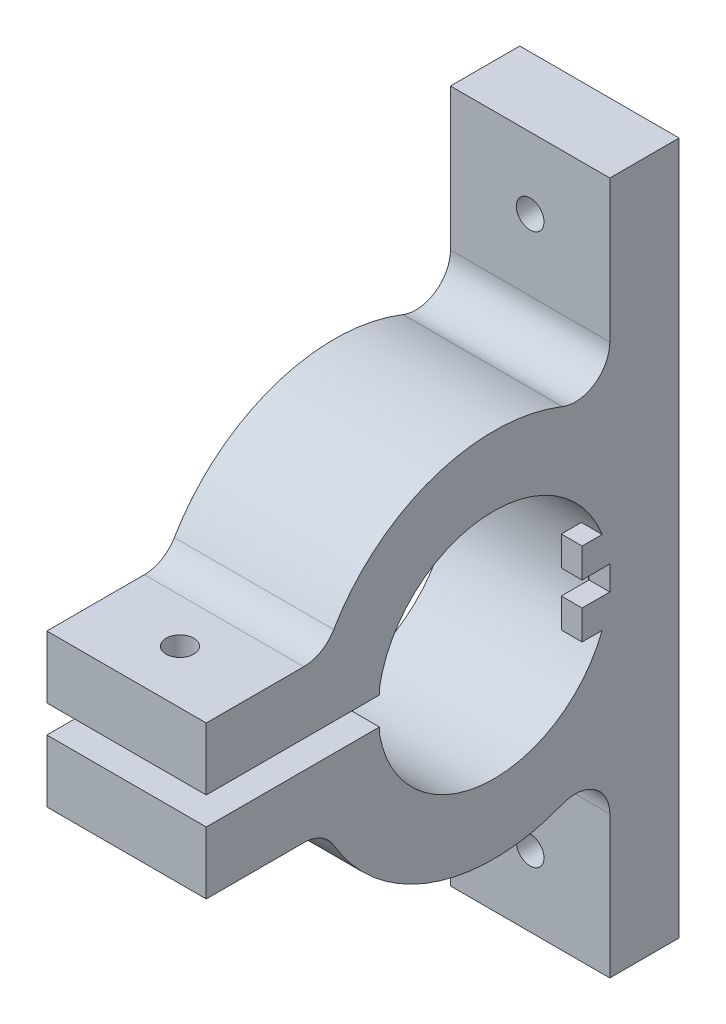
ISO-10303-21;
HEADER;
FILE_DESCRIPTION(('STEP AP214'),'2;1');
FILE_NAME('part.step','',(''),(''),'','','');
FILE_SCHEMA(('AUTOMOTIVE_DESIGN { 1 0 10303 214 1 1 1 1 }'));
ENDSEC;
DATA;
#1=APPLICATION_CONTEXT('core data for automotive mechanical design processes');
#2=APPLICATION_PROTOCOL_DEFINITION('international standard','automotive_design',2000,#1);
#3=PRODUCT_CONTEXT('',#1,'mechanical');
#4=PRODUCT('Part','Part','',(#3));
#5=PRODUCT_RELATED_PRODUCT_CATEGORY('part','',(#4));
#6=PRODUCT_DEFINITION_FORMATION('','',#4);
#7=PRODUCT_DEFINITION_CONTEXT('part definition',#1,'design');
#8=PRODUCT_DEFINITION('design','',#6,#7);
#9=PRODUCT_DEFINITION_SHAPE('','',#8);
#10=(LENGTH_UNIT() NAMED_UNIT(*) SI_UNIT(.MILLI.,.METRE.));
#11=(NAMED_UNIT(*) PLANE_ANGLE_UNIT() SI_UNIT($,.RADIAN.));
#12=(NAMED_UNIT(*) SI_UNIT($,.STERADIAN.) SOLID_ANGLE_UNIT());
#13=UNCERTAINTY_MEASURE_WITH_UNIT(LENGTH_MEASURE(1.E-05),#10,'distance_accuracy_value','');
#14=(GEOMETRIC_REPRESENTATION_CONTEXT(3) GLOBAL_UNCERTAINTY_ASSIGNED_CONTEXT((#13)) GLOBAL_UNIT_ASSIGNED_CONTEXT((#10,
#11,#12)) REPRESENTATION_CONTEXT('',''));
#15=CARTESIAN_POINT('',(0.,0.,0.));
#16=DIRECTION('',(0.,0.,1.));
#17=DIRECTION('',(1.,0.,0.));
#18=AXIS2_PLACEMENT_3D('',#15,#16,#17);
#19=CARTESIAN_POINT('',(53.,0.,7.375));
#20=DIRECTION('',(1.,0.,0.));
#21=DIRECTION('',(0.,1.,0.));
#22=AXIS2_PLACEMENT_3D('',#19,#20,#21);
#23=PLANE('',#22);
#24=CARTESIAN_POINT('',(53.,29.4957624075053,-11.75));
#25=DIRECTION('',(-1.,0.,0.));
#26=DIRECTION('',(0.,-0.827671051854987,-0.561213533266313));
#27=AXIS2_PLACEMENT_3D('',#24,#25,#26);
#28=CIRCLE('',#27,5.);
#29=CARTESIAN_POINT('',(53.,29.4957624075053,-16.75));
#30=VERTEX_POINT('',#29);
#31=CARTESIAN_POINT('',(53.,24.8507604535674,-9.89960629921261));
#32=VERTEX_POINT('',#31);
#33=EDGE_CURVE('E353',#30,#32,#28,.T.);
#34=ORIENTED_EDGE('',*,*,#33,.F.);
#35=DIRECTION('',(0.,1.,0.));
#36=VECTOR('',#35,1.);
#37=CARTESIAN_POINT('',(53.,-20.8566536146142,-16.75));
#38=LINE('',#37,#36);
#39=CARTESIAN_POINT('',(53.,50.,-16.75));
#40=VERTEX_POINT('',#39);
#41=EDGE_CURVE('E325',#30,#40,#38,.T.);
#42=ORIENTED_EDGE('',*,*,#41,.T.);
#43=DIRECTION('',(0.,0.,-1.));
#44=VECTOR('',#43,1.);
#45=CARTESIAN_POINT('',(53.,50.,-16.75));
#46=LINE('',#45,#44);
#47=CARTESIAN_POINT('',(53.,50.,-26.75));
#48=VERTEX_POINT('',#47);
#49=EDGE_CURVE('E328',#40,#48,#46,.T.);
#50=ORIENTED_EDGE('',*,*,#49,.T.);
#51=DIRECTION('',(0.,-1.,0.));
#52=VECTOR('',#51,1.);
#53=CARTESIAN_POINT('',(53.,-12.8256433147341,-26.75));
#54=LINE('',#53,#52);
#55=CARTESIAN_POINT('',(53.,-50.,-26.75));
#56=VERTEX_POINT('',#55);
#57=EDGE_CURVE('E432',#48,#56,#54,.T.);
#58=ORIENTED_EDGE('',*,*,#57,.T.);
#59=DIRECTION('',(0.,0.,1.));
#60=VECTOR('',#59,1.);
#61=CARTESIAN_POINT('',(53.,-50.,-26.75));
#62=LINE('',#61,#60);
#63=CARTESIAN_POINT('',(53.,-50.,-16.75));
#64=VERTEX_POINT('',#63);
#65=EDGE_CURVE('E420',#56,#64,#62,.T.);
#66=ORIENTED_EDGE('',*,*,#65,.T.);
#67=DIRECTION('',(0.,1.,0.));
#68=VECTOR('',#67,1.);
#69=CARTESIAN_POINT('',(53.,-50.,-16.75));
#70=LINE('',#69,#68);
#71=CARTESIAN_POINT('',(53.,-29.4957624075053,-16.75));
#72=VERTEX_POINT('',#71);
#73=EDGE_CURVE('E379',#64,#72,#70,.T.);
#74=ORIENTED_EDGE('',*,*,#73,.T.);
#75=CARTESIAN_POINT('',(53.,-29.4957624075053,-11.75));
#76=DIRECTION('',(-1.,0.,0.));
#77=DIRECTION('',(0.,0.827671051854988,-0.561213533266313));
#78=AXIS2_PLACEMENT_3D('',#75,#76,#77);
#79=CIRCLE('',#78,5.);
#80=CARTESIAN_POINT('',(53.,-24.8507604535674,-9.8996062992126));
#81=VERTEX_POINT('',#80);
#82=EDGE_CURVE('E280',#81,#72,#79,.T.);
#83=ORIENTED_EDGE('',*,*,#82,.F.);
#84=CARTESIAN_POINT('',(53.,0.,0.));
#85=DIRECTION('',(1.,0.,0.));
#86=DIRECTION('',(0.,1.,0.));
#87=AXIS2_PLACEMENT_3D('',#84,#85,#86);
#88=CIRCLE('',#87,26.75);
#89=CARTESIAN_POINT('',(53.,-13.4803149606299,23.1050559090909));
#90=VERTEX_POINT('',#89);
#91=EDGE_CURVE('E266',#90,#81,#88,.T.);
#92=ORIENTED_EDGE('',*,*,#91,.F.);
#93=CARTESIAN_POINT('',(53.,-16.,27.4237579481734));
#94=DIRECTION('',(-1.,0.,0.));
#95=DIRECTION('',(0.,0.867161175293848,-0.498027605723811));
#96=AXIS2_PLACEMENT_3D('',#93,#94,#95);
#97=CIRCLE('',#96,5.);
#98=CARTESIAN_POINT('',(53.,-11.,27.4237579481734));
#99=VERTEX_POINT('',#98);
#100=EDGE_CURVE('E20',#99,#90,#97,.T.);
#101=ORIENTED_EDGE('',*,*,#100,.F.);
#102=DIRECTION('',(0.,0.,1.));
#103=VECTOR('',#102,1.);
#104=CARTESIAN_POINT('',(53.,-11.,16.5));
#105=LINE('',#104,#103);
#106=CARTESIAN_POINT('',(53.,-11.,41.5));
#107=VERTEX_POINT('',#106);
#108=EDGE_CURVE('E371',#99,#107,#105,.T.);
#109=ORIENTED_EDGE('',*,*,#108,.T.);
#110=DIRECTION('',(0.,1.,0.));
#111=VECTOR('',#110,1.);
#112=CARTESIAN_POINT('',(53.,-11.,41.5));
#113=LINE('',#112,#111);
#114=CARTESIAN_POINT('',(53.,-2.,41.5));
#115=VERTEX_POINT('',#114);
#116=EDGE_CURVE('E261',#107,#115,#113,.T.);
#117=ORIENTED_EDGE('',*,*,#116,.T.);
#118=DIRECTION('',(0.,0.,-1.));
#119=VECTOR('',#118,1.);
#120=CARTESIAN_POINT('',(53.,-2.,41.5));
#121=LINE('',#120,#119);
#122=CARTESIAN_POINT('',(53.,-2.,16.5));
#123=VERTEX_POINT('',#122);
#124=EDGE_CURVE('E260',#115,#123,#121,.T.);
#125=ORIENTED_EDGE('',*,*,#124,.T.);
#126=DIRECTION('',(0.,-1.,0.));
#127=VECTOR('',#126,1.);
#128=CARTESIAN_POINT('',(53.,-2.,16.5));
#129=LINE('',#128,#127);
#130=CARTESIAN_POINT('',(53.,-2.8831406486677,16.5));
#131=VERTEX_POINT('',#130);
#132=EDGE_CURVE('E444',#123,#131,#129,.T.);
#133=ORIENTED_EDGE('',*,*,#132,.T.);
#134=CARTESIAN_POINT('',(53.,0.,0.));
#135=DIRECTION('',(1.,0.,0.));
#136=DIRECTION('',(0.,1.,0.));
#137=AXIS2_PLACEMENT_3D('',#134,#135,#136);
#138=CIRCLE('',#137,16.75);
#139=CARTESIAN_POINT('',(53.,2.8831406486677,16.5));
#140=VERTEX_POINT('',#139);
#141=EDGE_CURVE('E434',#131,#140,#138,.T.);
#142=ORIENTED_EDGE('',*,*,#141,.T.);
#143=DIRECTION('',(0.,1.,0.));
#144=VECTOR('',#143,1.);
#145=CARTESIAN_POINT('',(53.,2.,16.5));
#146=LINE('',#145,#144);
#147=CARTESIAN_POINT('',(53.,2.,16.5));
#148=VERTEX_POINT('',#147);
#149=EDGE_CURVE('E302',#148,#140,#146,.T.);
#150=ORIENTED_EDGE('',*,*,#149,.F.);
#151=DIRECTION('',(0.,0.,-1.));
#152=VECTOR('',#151,1.);
#153=CARTESIAN_POINT('',(53.,2.,41.5));
#154=LINE('',#153,#152);
#155=CARTESIAN_POINT('',(53.,2.,41.5));
#156=VERTEX_POINT('',#155);
#157=EDGE_CURVE('E342',#156,#148,#154,.T.);
#158=ORIENTED_EDGE('',*,*,#157,.F.);
#159=DIRECTION('',(0.,-1.,0.));
#160=VECTOR('',#159,1.);
#161=CARTESIAN_POINT('',(53.,11.,41.5));
#162=LINE('',#161,#160);
#163=CARTESIAN_POINT('',(53.,11.,41.5));
#164=VERTEX_POINT('',#163);
#165=EDGE_CURVE('E11',#164,#156,#162,.T.);
#166=ORIENTED_EDGE('',*,*,#165,.F.);
#167=DIRECTION('',(0.,0.,1.));
#168=VECTOR('',#167,1.);
#169=CARTESIAN_POINT('',(53.,11.,16.5));
#170=LINE('',#169,#168);
#171=CARTESIAN_POINT('',(53.,11.,27.4237579481734));
#172=VERTEX_POINT('',#171);
#173=EDGE_CURVE('E317',#172,#164,#170,.T.);
#174=ORIENTED_EDGE('',*,*,#173,.F.);
#175=CARTESIAN_POINT('',(53.,16.,27.4237579481734));
#176=DIRECTION('',(-1.,0.,0.));
#177=DIRECTION('',(0.,-0.867161175293848,-0.498027605723811));
#178=AXIS2_PLACEMENT_3D('',#175,#176,#177);
#179=CIRCLE('',#178,5.);
#180=CARTESIAN_POINT('',(53.,13.4803149606299,23.1050559090909));
#181=VERTEX_POINT('',#180);
#182=EDGE_CURVE('E351',#181,#172,#179,.T.);
#183=ORIENTED_EDGE('',*,*,#182,.F.);
#184=CARTESIAN_POINT('',(53.,0.,0.));
#185=DIRECTION('',(1.,0.,0.));
#186=DIRECTION('',(0.,1.,0.));
#187=AXIS2_PLACEMENT_3D('',#184,#185,#186);
#188=CIRCLE('',#187,26.75);
#189=EDGE_CURVE('E331',#32,#181,#188,.T.);
#190=ORIENTED_EDGE('',*,*,#189,.F.);
#191=EDGE_LOOP('',(#34,#42,#50,#58,#66,#74,#83,#92,#101,#109,#117,#125,#133,#142,#150,#158,#166,
#174,#183,#190));
#192=FACE_BOUND('',#191,.T.);
#193=ADVANCED_FACE('F16',(#192),#23,.F.);
#194=CARTESIAN_POINT('',(73.,0.,7.375));
#195=DIRECTION('',(1.,0.,0.));
#196=DIRECTION('',(0.,1.,0.));
#197=AXIS2_PLACEMENT_3D('',#194,#195,#196);
#198=PLANE('',#197);
#199=DIRECTION('',(0.,0.,1.));
#200=VECTOR('',#199,1.);
#201=CARTESIAN_POINT('',(73.,1.75,-2.6875));
#202=LINE('',#201,#200);
#203=CARTESIAN_POINT('',(73.,1.75,-16.75));
#204=VERTEX_POINT('',#203);
#205=CARTESIAN_POINT('',(73.,1.75,-16.6583312489577));
#206=VERTEX_POINT('',#205);
#207=EDGE_CURVE('E228',#204,#206,#202,.T.);
#208=ORIENTED_EDGE('',*,*,#207,.T.);
#209=CARTESIAN_POINT('',(73.,0.,0.));
#210=DIRECTION('',(-1.,0.,0.));
#211=DIRECTION('',(0.,1.,0.));
#212=AXIS2_PLACEMENT_3D('',#209,#210,#211);
#213=CIRCLE('',#212,16.75);
#214=CARTESIAN_POINT('',(73.,0.,-16.75));
#215=VERTEX_POINT('',#214);
#216=EDGE_CURVE('E244',#206,#215,#213,.T.);
#217=ORIENTED_EDGE('',*,*,#216,.T.);
#218=DIRECTION('',(0.,1.,0.));
#219=VECTOR('',#218,1.);
#220=CARTESIAN_POINT('',(73.,0.874999999999978,-16.75));
#221=LINE('',#220,#219);
#222=EDGE_CURVE('E240',#215,#204,#221,.T.);
#223=ORIENTED_EDGE('',*,*,#222,.T.);
#224=EDGE_LOOP('',(#208,#217,#223));
#225=FACE_BOUND('',#224,.T.);
#226=ADVANCED_FACE('F243',(#225),#198,.T.);
#227=CARTESIAN_POINT('',(53.,11.,41.5));
#228=DIRECTION('',(0.,0.,1.));
#229=DIRECTION('',(0.,-1.,0.));
#230=AXIS2_PLACEMENT_3D('',#227,#228,#229);
#231=PLANE('',#230);
#232=ORIENTED_EDGE('',*,*,#165,.T.);
#233=DIRECTION('',(1.,0.,0.));
#234=VECTOR('',#233,1.);
#235=CARTESIAN_POINT('',(53.,2.,41.5));
#236=LINE('',#235,#234);
#237=CARTESIAN_POINT('',(76.,2.,41.5));
#238=VERTEX_POINT('',#237);
#239=EDGE_CURVE('E26',#156,#238,#236,.T.);
#240=ORIENTED_EDGE('',*,*,#239,.T.);
#241=DIRECTION('',(0.,-1.,0.));
#242=VECTOR('',#241,1.);
#243=CARTESIAN_POINT('',(76.,11.,41.5));
#244=LINE('',#243,#242);
#245=CARTESIAN_POINT('',(76.,11.,41.5));
#246=VERTEX_POINT('',#245);
#247=EDGE_CURVE('E382',#246,#238,#244,.T.);
#248=ORIENTED_EDGE('',*,*,#247,.F.);
#249=DIRECTION('',(1.,0.,0.));
#250=VECTOR('',#249,1.);
#251=CARTESIAN_POINT('',(53.,11.,41.5));
#252=LINE('',#251,#250);
#253=EDGE_CURVE('E257',#164,#246,#252,.T.);
#254=ORIENTED_EDGE('',*,*,#253,.F.);
#255=EDGE_LOOP('',(#232,#240,#248,#254));
#256=FACE_BOUND('',#255,.T.);
#257=ADVANCED_FACE('F564',(#256),#231,.T.);
#258=CARTESIAN_POINT('',(53.,2.,41.5));
#259=DIRECTION('',(0.,-1.,0.));
#260=DIRECTION('',(0.,0.,-1.));
#261=AXIS2_PLACEMENT_3D('',#258,#259,#260);
#262=PLANE('',#261);
#263=ORIENTED_EDGE('',*,*,#157,.T.);
#264=DIRECTION('',(1.,0.,0.));
#265=VECTOR('',#264,1.);
#266=CARTESIAN_POINT('',(53.,2.,16.5));
#267=LINE('',#266,#265);
#268=CARTESIAN_POINT('',(76.,2.,16.5));
#269=VERTEX_POINT('',#268);
#270=EDGE_CURVE('E415',#148,#269,#267,.T.);
#271=ORIENTED_EDGE('',*,*,#270,.T.);
#272=DIRECTION('',(0.,0.,-1.));
#273=VECTOR('',#272,1.);
#274=CARTESIAN_POINT('',(76.,2.,41.5));
#275=LINE('',#274,#273);
#276=EDGE_CURVE('E367',#238,#269,#275,.T.);
#277=ORIENTED_EDGE('',*,*,#276,.F.);
#278=ORIENTED_EDGE('',*,*,#239,.F.);
#279=EDGE_LOOP('',(#263,#271,#277,#278));
#280=FACE_BOUND('',#279,.T.);
#281=CARTESIAN_POINT('',(64.5,2.,33.7993654806982));
#282=DIRECTION('',(0.,1.,0.));
#283=DIRECTION('',(-1.,0.,0.));
#284=AXIS2_PLACEMENT_3D('',#281,#282,#283);
#285=CIRCLE('',#284,2.);
#286=CARTESIAN_POINT('',(66.5,2.,33.7993654806982));
#287=VERTEX_POINT('',#286);
#288=EDGE_CURVE('E359',#287,#287,#285,.T.);
#289=ORIENTED_EDGE('',*,*,#288,.T.);
#290=EDGE_LOOP('',(#289));
#291=FACE_BOUND('',#290,.T.);
#292=ADVANCED_FACE('F569',(#280,#291),#262,.T.);
#293=CARTESIAN_POINT('',(53.,2.,16.5));
#294=DIRECTION('',(0.,0.,-1.));
#295=DIRECTION('',(0.,1.,0.));
#296=AXIS2_PLACEMENT_3D('',#293,#294,#295);
#297=PLANE('',#296);
#298=ORIENTED_EDGE('',*,*,#149,.T.);
#299=DIRECTION('',(1.,0.,0.));
#300=VECTOR('',#299,1.);
#301=CARTESIAN_POINT('',(53.,2.8831406486677,16.5));
#302=LINE('',#301,#300);
#303=CARTESIAN_POINT('',(76.,2.88314064866771,16.5));
#304=VERTEX_POINT('',#303);
#305=EDGE_CURVE('E300',#140,#304,#302,.T.);
#306=ORIENTED_EDGE('',*,*,#305,.T.);
#307=DIRECTION('',(0.,1.,0.));
#308=VECTOR('',#307,1.);
#309=CARTESIAN_POINT('',(76.,2.,16.5));
#310=LINE('',#309,#308);
#311=EDGE_CURVE('E363',#269,#304,#310,.T.);
#312=ORIENTED_EDGE('',*,*,#311,.F.);
#313=ORIENTED_EDGE('',*,*,#270,.F.);
#314=EDGE_LOOP('',(#298,#306,#312,#313));
#315=FACE_BOUND('',#314,.T.);
#316=ADVANCED_FACE('F575',(#315),#297,.T.);
#317=CARTESIAN_POINT('',(53.,0.,0.));
#318=DIRECTION('',(-1.,0.,0.));
#319=DIRECTION('',(0.,1.,0.));
#320=AXIS2_PLACEMENT_3D('',#317,#318,#319);
#321=CYLINDRICAL_SURFACE('',#320,16.75);
#322=ORIENTED_EDGE('',*,*,#141,.F.);
#323=DIRECTION('',(1.,0.,0.));
#324=VECTOR('',#323,1.);
#325=CARTESIAN_POINT('',(53.,-2.8831406486677,16.5));
#326=LINE('',#325,#324);
#327=CARTESIAN_POINT('',(76.,-2.88314064866769,16.5));
#328=VERTEX_POINT('',#327);
#329=EDGE_CURVE('E452',#131,#328,#326,.T.);
#330=ORIENTED_EDGE('',*,*,#329,.T.);
#331=CARTESIAN_POINT('',(76.,0.,0.));
#332=DIRECTION('',(-1.,0.,0.));
#333=DIRECTION('',(0.,-0.172127799920459,0.985074626865672));
#334=AXIS2_PLACEMENT_3D('',#331,#332,#333);
#335=CIRCLE('',#334,16.75);
#336=CARTESIAN_POINT('',(76.,-6.,-15.6384941730334));
#337=VERTEX_POINT('',#336);
#338=EDGE_CURVE('E284',#337,#328,#335,.T.);
#339=ORIENTED_EDGE('',*,*,#338,.F.);
#340=DIRECTION('',(1.,0.,0.));
#341=VECTOR('',#340,1.);
#342=CARTESIAN_POINT('',(73.,-6.,-15.6384941730334));
#343=LINE('',#342,#341);
#344=CARTESIAN_POINT('',(73.,-6.,-15.6384941730334));
#345=VERTEX_POINT('',#344);
#346=EDGE_CURVE('E303',#345,#337,#343,.T.);
#347=ORIENTED_EDGE('',*,*,#346,.F.);
#348=CARTESIAN_POINT('',(73.,0.,0.));
#349=DIRECTION('',(-1.,0.,0.));
#350=DIRECTION('',(0.,1.,0.));
#351=AXIS2_PLACEMENT_3D('',#348,#349,#350);
#352=CIRCLE('',#351,16.75);
#353=CARTESIAN_POINT('',(73.,-1.75,-16.6583312489577));
#354=VERTEX_POINT('',#353);
#355=EDGE_CURVE('E262',#354,#345,#352,.T.);
#356=ORIENTED_EDGE('',*,*,#355,.F.);
#357=CARTESIAN_POINT('',(73.,0.,0.));
#358=DIRECTION('',(-1.,0.,0.));
#359=DIRECTION('',(0.,1.,0.));
#360=AXIS2_PLACEMENT_3D('',#357,#358,#359);
#361=CIRCLE('',#360,16.75);
#362=EDGE_CURVE('E412',#215,#354,#361,.T.);
#363=ORIENTED_EDGE('',*,*,#362,.F.);
#364=ORIENTED_EDGE('',*,*,#216,.F.);
#365=CARTESIAN_POINT('',(73.,0.,0.));
#366=DIRECTION('',(-1.,0.,0.));
#367=DIRECTION('',(0.,1.,0.));
#368=AXIS2_PLACEMENT_3D('',#365,#366,#367);
#369=CIRCLE('',#368,16.75);
#370=CARTESIAN_POINT('',(73.,6.,-15.6384941730334));
#371=VERTEX_POINT('',#370);
#372=EDGE_CURVE('E270',#371,#206,#369,.T.);
#373=ORIENTED_EDGE('',*,*,#372,.F.);
#374=DIRECTION('',(1.,0.,0.));
#375=VECTOR('',#374,1.);
#376=CARTESIAN_POINT('',(73.,6.,-15.6384941730334));
#377=LINE('',#376,#375);
#378=CARTESIAN_POINT('',(76.,6.,-15.6384941730334));
#379=VERTEX_POINT('',#378);
#380=EDGE_CURVE('E281',#371,#379,#377,.T.);
#381=ORIENTED_EDGE('',*,*,#380,.T.);
#382=CARTESIAN_POINT('',(76.,0.,0.));
#383=DIRECTION('',(-1.,0.,0.));
#384=DIRECTION('',(0.,-0.172127799920459,0.985074626865672));
#385=AXIS2_PLACEMENT_3D('',#382,#383,#384);
#386=CIRCLE('',#385,16.75);
#387=EDGE_CURVE('E366',#304,#379,#386,.T.);
#388=ORIENTED_EDGE('',*,*,#387,.F.);
#389=ORIENTED_EDGE('',*,*,#305,.F.);
#390=EDGE_LOOP('',(#322,#330,#339,#347,#356,#363,#364,#373,#381,#388,#389));
#391=FACE_BOUND('',#390,.T.);
#392=ADVANCED_FACE('F579',(#391),#321,.F.);
#393=CARTESIAN_POINT('',(53.,-2.8831406486677,16.5));
#394=DIRECTION('',(0.,0.,-1.));
#395=DIRECTION('',(0.,1.,0.));
#396=AXIS2_PLACEMENT_3D('',#393,#394,#395);
#397=PLANE('',#396);
#398=ORIENTED_EDGE('',*,*,#132,.F.);
#399=DIRECTION('',(1.,0.,0.));
#400=VECTOR('',#399,1.);
#401=CARTESIAN_POINT('',(53.,-2.,16.5));
#402=LINE('',#401,#400);
#403=CARTESIAN_POINT('',(76.,-2.,16.5));
#404=VERTEX_POINT('',#403);
#405=EDGE_CURVE('E427',#123,#404,#402,.T.);
#406=ORIENTED_EDGE('',*,*,#405,.T.);
#407=DIRECTION('',(0.,1.,0.));
#408=VECTOR('',#407,1.);
#409=CARTESIAN_POINT('',(76.,-2.88314064866769,16.5));
#410=LINE('',#409,#408);
#411=EDGE_CURVE('E295',#328,#404,#410,.T.);
#412=ORIENTED_EDGE('',*,*,#411,.F.);
#413=ORIENTED_EDGE('',*,*,#329,.F.);
#414=EDGE_LOOP('',(#398,#406,#412,#413));
#415=FACE_BOUND('',#414,.T.);
#416=ADVANCED_FACE('F597',(#415),#397,.T.);
#417=CARTESIAN_POINT('',(53.,-2.,16.5));
#418=DIRECTION('',(0.,1.,0.));
#419=DIRECTION('',(0.,0.,1.));
#420=AXIS2_PLACEMENT_3D('',#417,#418,#419);
#421=PLANE('',#420);
#422=ORIENTED_EDGE('',*,*,#124,.F.);
#423=DIRECTION('',(1.,0.,0.));
#424=VECTOR('',#423,1.);
#425=CARTESIAN_POINT('',(53.,-2.,41.5));
#426=LINE('',#425,#424);
#427=CARTESIAN_POINT('',(76.,-2.,41.5));
#428=VERTEX_POINT('',#427);
#429=EDGE_CURVE('E258',#115,#428,#426,.T.);
#430=ORIENTED_EDGE('',*,*,#429,.T.);
#431=DIRECTION('',(0.,0.,1.));
#432=VECTOR('',#431,1.);
#433=CARTESIAN_POINT('',(76.,-2.,16.5));
#434=LINE('',#433,#432);
#435=EDGE_CURVE('E291',#404,#428,#434,.T.);
#436=ORIENTED_EDGE('',*,*,#435,.F.);
#437=ORIENTED_EDGE('',*,*,#405,.F.);
#438=EDGE_LOOP('',(#422,#430,#436,#437));
#439=FACE_BOUND('',#438,.T.);
#440=CARTESIAN_POINT('',(64.5,-2.,33.7993654806982));
#441=DIRECTION('',(0.,-1.,0.));
#442=DIRECTION('',(-1.,0.,0.));
#443=AXIS2_PLACEMENT_3D('',#440,#441,#442);
#444=CIRCLE('',#443,2.);
#445=CARTESIAN_POINT('',(66.5,-2.,33.7993654806982));
#446=VERTEX_POINT('',#445);
#447=EDGE_CURVE('E321',#446,#446,#444,.T.);
#448=ORIENTED_EDGE('',*,*,#447,.T.);
#449=EDGE_LOOP('',(#448));
#450=FACE_BOUND('',#449,.T.);
#451=ADVANCED_FACE('F600',(#439,#450),#421,.T.);
#452=CARTESIAN_POINT('',(53.,-2.,41.5));
#453=DIRECTION('',(0.,0.,1.));
#454=DIRECTION('',(0.,-1.,0.));
#455=AXIS2_PLACEMENT_3D('',#452,#453,#454);
#456=PLANE('',#455);
#457=ORIENTED_EDGE('',*,*,#116,.F.);
#458=DIRECTION('',(1.,0.,0.));
#459=VECTOR('',#458,1.);
#460=CARTESIAN_POINT('',(53.,-11.,41.5));
#461=LINE('',#460,#459);
#462=CARTESIAN_POINT('',(76.,-11.,41.5));
#463=VERTEX_POINT('',#462);
#464=EDGE_CURVE('E374',#107,#463,#461,.T.);
#465=ORIENTED_EDGE('',*,*,#464,.T.);
#466=DIRECTION('',(0.,-1.,0.));
#467=VECTOR('',#466,1.);
#468=CARTESIAN_POINT('',(76.,-2.,41.5));
#469=LINE('',#468,#467);
#470=EDGE_CURVE('E294',#428,#463,#469,.T.);
#471=ORIENTED_EDGE('',*,*,#470,.F.);
#472=ORIENTED_EDGE('',*,*,#429,.F.);
#473=EDGE_LOOP('',(#457,#465,#471,#472));
#474=FACE_BOUND('',#473,.T.);
#475=ADVANCED_FACE('F514',(#474),#456,.T.);
#476=CARTESIAN_POINT('',(53.,-11.,41.5));
#477=DIRECTION('',(0.,-1.,0.));
#478=DIRECTION('',(0.,0.,-1.));
#479=AXIS2_PLACEMENT_3D('',#476,#477,#478);
#480=PLANE('',#479);
#481=DIRECTION('',(-1.,0.,0.));
#482=VECTOR('',#481,1.);
#483=CARTESIAN_POINT('',(53.,-11.,27.4237579481734));
#484=LINE('',#483,#482);
#485=CARTESIAN_POINT('',(76.,-11.,27.4237579481734));
#486=VERTEX_POINT('',#485);
#487=EDGE_CURVE('E389',#486,#99,#484,.T.);
#488=ORIENTED_EDGE('',*,*,#487,.F.);
#489=DIRECTION('',(0.,0.,-1.));
#490=VECTOR('',#489,1.);
#491=CARTESIAN_POINT('',(76.,-11.,41.5));
#492=LINE('',#491,#490);
#493=EDGE_CURVE('E332',#463,#486,#492,.T.);
#494=ORIENTED_EDGE('',*,*,#493,.F.);
#495=ORIENTED_EDGE('',*,*,#464,.F.);
#496=ORIENTED_EDGE('',*,*,#108,.F.);
#497=EDGE_LOOP('',(#488,#494,#495,#496));
#498=FACE_BOUND('',#497,.T.);
#499=CARTESIAN_POINT('',(64.5,-11.,33.7993654806982));
#500=DIRECTION('',(0.,1.,0.));
#501=DIRECTION('',(-1.,0.,0.));
#502=AXIS2_PLACEMENT_3D('',#499,#500,#501);
#503=CIRCLE('',#502,2.);
#504=CARTESIAN_POINT('',(66.5,-11.,33.7993654806982));
#505=VERTEX_POINT('',#504);
#506=EDGE_CURVE('E319',#505,#505,#503,.T.);
#507=ORIENTED_EDGE('',*,*,#506,.T.);
#508=EDGE_LOOP('',(#507));
#509=FACE_BOUND('',#508,.T.);
#510=ADVANCED_FACE('F517',(#498,#509),#480,.T.);
#511=CARTESIAN_POINT('',(53.,-50.,-16.75));
#512=DIRECTION('',(0.,-1.,0.));
#513=DIRECTION('',(0.,0.,-1.));
#514=AXIS2_PLACEMENT_3D('',#511,#512,#513);
#515=PLANE('',#514);
#516=ORIENTED_EDGE('',*,*,#65,.F.);
#517=DIRECTION('',(1.,0.,0.));
#518=VECTOR('',#517,1.);
#519=CARTESIAN_POINT('',(53.,-50.,-26.75));
#520=LINE('',#519,#518);
#521=CARTESIAN_POINT('',(76.,-50.,-26.75));
#522=VERTEX_POINT('',#521);
#523=EDGE_CURVE('E422',#56,#522,#520,.T.);
#524=ORIENTED_EDGE('',*,*,#523,.T.);
#525=DIRECTION('',(0.,0.,-1.));
#526=VECTOR('',#525,1.);
#527=CARTESIAN_POINT('',(76.,-50.,-16.75));
#528=LINE('',#527,#526);
#529=CARTESIAN_POINT('',(76.,-50.,-16.75));
#530=VERTEX_POINT('',#529);
#531=EDGE_CURVE('E334',#530,#522,#528,.T.);
#532=ORIENTED_EDGE('',*,*,#531,.F.);
#533=DIRECTION('',(1.,0.,0.));
#534=VECTOR('',#533,1.);
#535=CARTESIAN_POINT('',(53.,-50.,-16.75));
#536=LINE('',#535,#534);
#537=EDGE_CURVE('E375',#64,#530,#536,.T.);
#538=ORIENTED_EDGE('',*,*,#537,.F.);
#539=EDGE_LOOP('',(#516,#524,#532,#538));
#540=FACE_BOUND('',#539,.T.);
#541=ADVANCED_FACE('F18',(#540),#515,.T.);
#542=CARTESIAN_POINT('',(53.,-50.,-26.75));
#543=DIRECTION('',(0.,0.,-1.));
#544=DIRECTION('',(0.,1.,0.));
#545=AXIS2_PLACEMENT_3D('',#542,#543,#544);
#546=PLANE('',#545);
#547=ORIENTED_EDGE('',*,*,#57,.F.);
#548=DIRECTION('',(1.,0.,0.));
#549=VECTOR('',#548,1.);
#550=CARTESIAN_POINT('',(53.,50.,-26.75));
#551=LINE('',#550,#549);
#552=CARTESIAN_POINT('',(76.,50.,-26.75));
#553=VERTEX_POINT('',#552);
#554=EDGE_CURVE('E340',#48,#553,#551,.T.);
#555=ORIENTED_EDGE('',*,*,#554,.T.);
#556=DIRECTION('',(0.,1.,0.));
#557=VECTOR('',#556,1.);
#558=CARTESIAN_POINT('',(76.,-50.,-26.75));
#559=LINE('',#558,#557);
#560=EDGE_CURVE('E355',#522,#553,#559,.T.);
#561=ORIENTED_EDGE('',*,*,#560,.F.);
#562=ORIENTED_EDGE('',*,*,#523,.F.);
#563=EDGE_LOOP('',(#547,#555,#561,#562));
#564=FACE_BOUND('',#563,.T.);
#565=CARTESIAN_POINT('',(64.5,-39.7478812037527,-26.75));
#566=DIRECTION('',(0.,0.,1.));
#567=DIRECTION('',(-1.,0.,0.));
#568=AXIS2_PLACEMENT_3D('',#565,#566,#567);
#569=CIRCLE('',#568,2.);
#570=CARTESIAN_POINT('',(66.5,-39.7478812037527,-26.75));
#571=VERTEX_POINT('',#570);
#572=EDGE_CURVE('E441',#571,#571,#569,.T.);
#573=ORIENTED_EDGE('',*,*,#572,.T.);
#574=EDGE_LOOP('',(#573));
#575=FACE_BOUND('',#574,.T.);
#576=CARTESIAN_POINT('',(64.5,39.7478812037527,-26.75));
#577=DIRECTION('',(0.,0.,1.));
#578=DIRECTION('',(-1.,0.,0.));
#579=AXIS2_PLACEMENT_3D('',#576,#577,#578);
#580=CIRCLE('',#579,2.);
#581=CARTESIAN_POINT('',(66.5,39.7478812037527,-26.75));
#582=VERTEX_POINT('',#581);
#583=EDGE_CURVE('E345',#582,#582,#580,.T.);
#584=ORIENTED_EDGE('',*,*,#583,.T.);
#585=EDGE_LOOP('',(#584));
#586=FACE_BOUND('',#585,.T.);
#587=ADVANCED_FACE('F536',(#564,#575,#586),#546,.T.);
#588=CARTESIAN_POINT('',(53.,50.,-26.75));
#589=DIRECTION('',(0.,1.,0.));
#590=DIRECTION('',(0.,0.,1.));
#591=AXIS2_PLACEMENT_3D('',#588,#589,#590);
#592=PLANE('',#591);
#593=ORIENTED_EDGE('',*,*,#49,.F.);
#594=DIRECTION('',(1.,0.,0.));
#595=VECTOR('',#594,1.);
#596=CARTESIAN_POINT('',(53.,50.,-16.75));
#597=LINE('',#596,#595);
#598=CARTESIAN_POINT('',(76.,50.,-16.75));
#599=VERTEX_POINT('',#598);
#600=EDGE_CURVE('E329',#40,#599,#597,.T.);
#601=ORIENTED_EDGE('',*,*,#600,.T.);
#602=DIRECTION('',(0.,0.,1.));
#603=VECTOR('',#602,1.);
#604=CARTESIAN_POINT('',(76.,50.,-26.75));
#605=LINE('',#604,#603);
#606=EDGE_CURVE('E358',#553,#599,#605,.T.);
#607=ORIENTED_EDGE('',*,*,#606,.F.);
#608=ORIENTED_EDGE('',*,*,#554,.F.);
#609=EDGE_LOOP('',(#593,#601,#607,#608));
#610=FACE_BOUND('',#609,.T.);
#611=ADVANCED_FACE('F541',(#610),#592,.T.);
#612=CARTESIAN_POINT('',(53.,50.,-16.75));
#613=DIRECTION('',(0.,0.,1.));
#614=DIRECTION('',(0.,-1.,0.));
#615=AXIS2_PLACEMENT_3D('',#612,#613,#614);
#616=PLANE('',#615);
#617=DIRECTION('',(-1.,0.,0.));
#618=VECTOR('',#617,1.);
#619=CARTESIAN_POINT('',(53.,29.4957624075053,-16.75));
#620=LINE('',#619,#618);
#621=CARTESIAN_POINT('',(76.,29.4957624075053,-16.75));
#622=VERTEX_POINT('',#621);
#623=EDGE_CURVE('E286',#622,#30,#620,.T.);
#624=ORIENTED_EDGE('',*,*,#623,.F.);
#625=DIRECTION('',(0.,-1.,0.));
#626=VECTOR('',#625,1.);
#627=CARTESIAN_POINT('',(76.,50.,-16.75));
#628=LINE('',#627,#626);
#629=EDGE_CURVE('E380',#599,#622,#628,.T.);
#630=ORIENTED_EDGE('',*,*,#629,.F.);
#631=ORIENTED_EDGE('',*,*,#600,.F.);
#632=ORIENTED_EDGE('',*,*,#41,.F.);
#633=EDGE_LOOP('',(#624,#630,#631,#632));
#634=FACE_BOUND('',#633,.T.);
#635=CARTESIAN_POINT('',(64.5,39.7478812037527,-16.75));
#636=DIRECTION('',(0.,0.,-1.));
#637=DIRECTION('',(-1.,0.,0.));
#638=AXIS2_PLACEMENT_3D('',#635,#636,#637);
#639=CIRCLE('',#638,2.);
#640=CARTESIAN_POINT('',(66.5,39.7478812037527,-16.75));
#641=VERTEX_POINT('',#640);
#642=EDGE_CURVE('E347',#641,#641,#639,.T.);
#643=ORIENTED_EDGE('',*,*,#642,.T.);
#644=EDGE_LOOP('',(#643));
#645=FACE_BOUND('',#644,.T.);
#646=ADVANCED_FACE('F547',(#634,#645),#616,.T.);
#647=CARTESIAN_POINT('',(73.,0.,7.375));
#648=DIRECTION('',(1.,0.,0.));
#649=DIRECTION('',(0.,1.,0.));
#650=AXIS2_PLACEMENT_3D('',#647,#648,#649);
#651=PLANE('',#650);
#652=DIRECTION('',(0.,1.,0.));
#653=VECTOR('',#652,1.);
#654=CARTESIAN_POINT('',(73.,0.874999999999978,-16.75));
#655=LINE('',#654,#653);
#656=CARTESIAN_POINT('',(73.,-1.75,-16.75));
#657=VERTEX_POINT('',#656);
#658=EDGE_CURVE('E253',#657,#215,#655,.T.);
#659=ORIENTED_EDGE('',*,*,#658,.T.);
#660=ORIENTED_EDGE('',*,*,#362,.T.);
#661=DIRECTION('',(0.,0.,-1.));
#662=VECTOR('',#661,1.);
#663=CARTESIAN_POINT('',(73.,-1.75,-4.6875));
#664=LINE('',#663,#662);
#665=EDGE_CURVE('E447',#354,#657,#664,.T.);
#666=ORIENTED_EDGE('',*,*,#665,.T.);
#667=EDGE_LOOP('',(#659,#660,#666));
#668=FACE_BOUND('',#667,.T.);
#669=ADVANCED_FACE('F641',(#668),#651,.T.);
#670=CARTESIAN_POINT('',(76.,3.875,-14.7041656244788));
#671=DIRECTION('',(1.,0.,0.));
#672=DIRECTION('',(0.,1.,0.));
#673=AXIS2_PLACEMENT_3D('',#670,#671,#672);
#674=PLANE('',#673);
#675=DIRECTION('',(0.,0.,1.));
#676=VECTOR('',#675,1.);
#677=CARTESIAN_POINT('',(76.,6.,-16.75));
#678=LINE('',#677,#676);
#679=CARTESIAN_POINT('',(76.,6.,-12.75));
#680=VERTEX_POINT('',#679);
#681=EDGE_CURVE('E285',#379,#680,#678,.T.);
#682=ORIENTED_EDGE('',*,*,#681,.T.);
#683=DIRECTION('',(0.,-1.,0.));
#684=VECTOR('',#683,1.);
#685=CARTESIAN_POINT('',(76.,6.,-12.75));
#686=LINE('',#685,#684);
#687=CARTESIAN_POINT('',(76.,1.75,-12.75));
#688=VERTEX_POINT('',#687);
#689=EDGE_CURVE('E272',#680,#688,#686,.T.);
#690=ORIENTED_EDGE('',*,*,#689,.T.);
#691=DIRECTION('',(0.,0.,-1.));
#692=VECTOR('',#691,1.);
#693=CARTESIAN_POINT('',(76.,1.75,-16.75));
#694=LINE('',#693,#692);
#695=CARTESIAN_POINT('',(76.,1.75,-16.75));
#696=VERTEX_POINT('',#695);
#697=EDGE_CURVE('E239',#688,#696,#694,.T.);
#698=ORIENTED_EDGE('',*,*,#697,.T.);
#699=DIRECTION('',(0.,-1.,0.));
#700=VECTOR('',#699,1.);
#701=CARTESIAN_POINT('',(76.,-1.75,-16.75));
#702=LINE('',#701,#700);
#703=CARTESIAN_POINT('',(76.,-1.75,-16.75));
#704=VERTEX_POINT('',#703);
#705=EDGE_CURVE('E251',#696,#704,#702,.T.);
#706=ORIENTED_EDGE('',*,*,#705,.T.);
#707=DIRECTION('',(0.,0.,1.));
#708=VECTOR('',#707,1.);
#709=CARTESIAN_POINT('',(76.,-1.75,-12.75));
#710=LINE('',#709,#708);
#711=CARTESIAN_POINT('',(76.,-1.75,-12.75));
#712=VERTEX_POINT('',#711);
#713=EDGE_CURVE('E307',#704,#712,#710,.T.);
#714=ORIENTED_EDGE('',*,*,#713,.T.);
#715=DIRECTION('',(0.,-1.,0.));
#716=VECTOR('',#715,1.);
#717=CARTESIAN_POINT('',(76.,6.,-12.75));
#718=LINE('',#717,#716);
#719=CARTESIAN_POINT('',(76.,-6.,-12.75));
#720=VERTEX_POINT('',#719);
#721=EDGE_CURVE('E337',#712,#720,#718,.T.);
#722=ORIENTED_EDGE('',*,*,#721,.T.);
#723=DIRECTION('',(0.,0.,-1.));
#724=VECTOR('',#723,1.);
#725=CARTESIAN_POINT('',(76.,-6.,-12.75));
#726=LINE('',#725,#724);
#727=EDGE_CURVE('E306',#720,#337,#726,.T.);
#728=ORIENTED_EDGE('',*,*,#727,.T.);
#729=ORIENTED_EDGE('',*,*,#338,.T.);
#730=ORIENTED_EDGE('',*,*,#411,.T.);
#731=ORIENTED_EDGE('',*,*,#435,.T.);
#732=ORIENTED_EDGE('',*,*,#470,.T.);
#733=ORIENTED_EDGE('',*,*,#493,.T.);
#734=CARTESIAN_POINT('',(76.,-16.,27.4237579481734));
#735=DIRECTION('',(1.,0.,0.));
#736=DIRECTION('',(0.,0.867161175293848,-0.498027605723811));
#737=AXIS2_PLACEMENT_3D('',#734,#735,#736);
#738=CIRCLE('',#737,5.);
#739=CARTESIAN_POINT('',(76.,-13.4803149606299,23.1050559090909));
#740=VERTEX_POINT('',#739);
#741=EDGE_CURVE('E395',#740,#486,#738,.T.);
#742=ORIENTED_EDGE('',*,*,#741,.F.);
#743=CARTESIAN_POINT('',(76.,0.,0.));
#744=DIRECTION('',(1.,0.,0.));
#745=DIRECTION('',(0.,-0.411214953271028,0.911538404131338));
#746=AXIS2_PLACEMENT_3D('',#743,#744,#745);
#747=CIRCLE('',#746,26.75);
#748=CARTESIAN_POINT('',(76.,-24.8507604535674,-9.8996062992126));
#749=VERTEX_POINT('',#748);
#750=EDGE_CURVE('E383',#740,#749,#747,.T.);
#751=ORIENTED_EDGE('',*,*,#750,.T.);
#752=CARTESIAN_POINT('',(76.,-29.4957624075053,-11.75));
#753=DIRECTION('',(1.,0.,0.));
#754=DIRECTION('',(0.,0.827671051854988,-0.561213533266313));
#755=AXIS2_PLACEMENT_3D('',#752,#753,#754);
#756=CIRCLE('',#755,5.);
#757=CARTESIAN_POINT('',(76.,-29.4957624075053,-16.75));
#758=VERTEX_POINT('',#757);
#759=EDGE_CURVE('E279',#758,#749,#756,.T.);
#760=ORIENTED_EDGE('',*,*,#759,.F.);
#761=DIRECTION('',(0.,-1.,0.));
#762=VECTOR('',#761,1.);
#763=CARTESIAN_POINT('',(76.,-20.8566536146143,-16.75));
#764=LINE('',#763,#762);
#765=EDGE_CURVE('E378',#758,#530,#764,.T.);
#766=ORIENTED_EDGE('',*,*,#765,.T.);
#767=ORIENTED_EDGE('',*,*,#531,.T.);
#768=ORIENTED_EDGE('',*,*,#560,.T.);
#769=ORIENTED_EDGE('',*,*,#606,.T.);
#770=ORIENTED_EDGE('',*,*,#629,.T.);
#771=CARTESIAN_POINT('',(76.,29.4957624075053,-11.75));
#772=DIRECTION('',(1.,0.,0.));
#773=DIRECTION('',(0.,-0.827671051854987,-0.561213533266313));
#774=AXIS2_PLACEMENT_3D('',#771,#772,#773);
#775=CIRCLE('',#774,5.);
#776=CARTESIAN_POINT('',(76.,24.8507604535674,-9.89960629921261));
#777=VERTEX_POINT('',#776);
#778=EDGE_CURVE('E290',#777,#622,#775,.T.);
#779=ORIENTED_EDGE('',*,*,#778,.F.);
#780=CARTESIAN_POINT('',(76.,0.,0.));
#781=DIRECTION('',(1.,0.,0.));
#782=DIRECTION('',(0.,0.779687985593054,-0.626168224299066));
#783=AXIS2_PLACEMENT_3D('',#780,#781,#782);
#784=CIRCLE('',#783,26.75);
#785=CARTESIAN_POINT('',(76.,13.4803149606299,23.105055909091));
#786=VERTEX_POINT('',#785);
#787=EDGE_CURVE('E289',#777,#786,#784,.T.);
#788=ORIENTED_EDGE('',*,*,#787,.T.);
#789=CARTESIAN_POINT('',(76.,16.,27.4237579481734));
#790=DIRECTION('',(1.,0.,0.));
#791=DIRECTION('',(0.,-0.867161175293848,-0.498027605723811));
#792=AXIS2_PLACEMENT_3D('',#789,#790,#791);
#793=CIRCLE('',#792,5.);
#794=CARTESIAN_POINT('',(76.,11.,27.4237579481734));
#795=VERTEX_POINT('',#794);
#796=EDGE_CURVE('E318',#795,#786,#793,.T.);
#797=ORIENTED_EDGE('',*,*,#796,.F.);
#798=DIRECTION('',(0.,0.,1.));
#799=VECTOR('',#798,1.);
#800=CARTESIAN_POINT('',(76.,11.,24.3836523105133));
#801=LINE('',#800,#799);
#802=EDGE_CURVE('E370',#795,#246,#801,.T.);
#803=ORIENTED_EDGE('',*,*,#802,.T.);
#804=ORIENTED_EDGE('',*,*,#247,.T.);
#805=ORIENTED_EDGE('',*,*,#276,.T.);
#806=ORIENTED_EDGE('',*,*,#311,.T.);
#807=ORIENTED_EDGE('',*,*,#387,.T.);
#808=EDGE_LOOP('',(#682,#690,#698,#706,#714,#722,#728,#729,#730,#731,#732,#733,#742,#751,#760,
#766,#767,#768,#769,#770,#779,#788,#797,#803,#804,#805,#806,#807));
#809=FACE_BOUND('',#808,.T.);
#810=ADVANCED_FACE('F482',(#809),#674,.T.);
#811=CARTESIAN_POINT('',(73.,6.,-15.6384941730334));
#812=DIRECTION('',(0.,1.,0.));
#813=DIRECTION('',(0.,0.,1.));
#814=AXIS2_PLACEMENT_3D('',#811,#812,#813);
#815=PLANE('',#814);
#816=DIRECTION('',(0.,0.,1.));
#817=VECTOR('',#816,1.);
#818=CARTESIAN_POINT('',(73.,6.,-16.75));
#819=LINE('',#818,#817);
#820=CARTESIAN_POINT('',(73.,6.,-12.75));
#821=VERTEX_POINT('',#820);
#822=EDGE_CURVE('E299',#371,#821,#819,.T.);
#823=ORIENTED_EDGE('',*,*,#822,.T.);
#824=DIRECTION('',(1.,0.,0.));
#825=VECTOR('',#824,1.);
#826=CARTESIAN_POINT('',(73.,6.,-12.75));
#827=LINE('',#826,#825);
#828=EDGE_CURVE('E273',#821,#680,#827,.T.);
#829=ORIENTED_EDGE('',*,*,#828,.T.);
#830=ORIENTED_EDGE('',*,*,#681,.F.);
#831=ORIENTED_EDGE('',*,*,#380,.F.);
#832=EDGE_LOOP('',(#823,#829,#830,#831));
#833=FACE_BOUND('',#832,.T.);
#834=ADVANCED_FACE('F584',(#833),#815,.T.);
#835=CARTESIAN_POINT('',(73.,6.,-12.75));
#836=DIRECTION('',(0.,0.,1.));
#837=DIRECTION('',(0.,-1.,0.));
#838=AXIS2_PLACEMENT_3D('',#835,#836,#837);
#839=PLANE('',#838);
#840=DIRECTION('',(0.,-1.,0.));
#841=VECTOR('',#840,1.);
#842=CARTESIAN_POINT('',(73.,6.,-12.75));
#843=LINE('',#842,#841);
#844=CARTESIAN_POINT('',(73.,1.75,-12.75));
#845=VERTEX_POINT('',#844);
#846=EDGE_CURVE('E296',#821,#845,#843,.T.);
#847=ORIENTED_EDGE('',*,*,#846,.T.);
#848=DIRECTION('',(1.,0.,0.));
#849=VECTOR('',#848,1.);
#850=CARTESIAN_POINT('',(73.,1.75,-12.75));
#851=LINE('',#850,#849);
#852=EDGE_CURVE('E274',#845,#688,#851,.T.);
#853=ORIENTED_EDGE('',*,*,#852,.T.);
#854=ORIENTED_EDGE('',*,*,#689,.F.);
#855=ORIENTED_EDGE('',*,*,#828,.F.);
#856=EDGE_LOOP('',(#847,#853,#854,#855));
#857=FACE_BOUND('',#856,.T.);
#858=ADVANCED_FACE('F588',(#857),#839,.T.);
#859=CARTESIAN_POINT('',(73.,1.75,-12.75));
#860=DIRECTION('',(0.,-1.,0.));
#861=DIRECTION('',(0.,0.,-1.));
#862=AXIS2_PLACEMENT_3D('',#859,#860,#861);
#863=PLANE('',#862);
#864=ORIENTED_EDGE('',*,*,#207,.F.);
#865=DIRECTION('',(1.,0.,0.));
#866=VECTOR('',#865,1.);
#867=CARTESIAN_POINT('',(73.,1.75,-16.75));
#868=LINE('',#867,#866);
#869=EDGE_CURVE('E233',#204,#696,#868,.T.);
#870=ORIENTED_EDGE('',*,*,#869,.T.);
#871=ORIENTED_EDGE('',*,*,#697,.F.);
#872=ORIENTED_EDGE('',*,*,#852,.F.);
#873=DIRECTION('',(0.,0.,1.));
#874=VECTOR('',#873,1.);
#875=CARTESIAN_POINT('',(73.,1.75,-16.75));
#876=LINE('',#875,#874);
#877=EDGE_CURVE('E236',#206,#845,#876,.T.);
#878=ORIENTED_EDGE('',*,*,#877,.F.);
#879=EDGE_LOOP('',(#864,#870,#871,#872,#878));
#880=FACE_BOUND('',#879,.T.);
#881=ADVANCED_FACE('F230',(#880),#863,.T.);
#882=CARTESIAN_POINT('',(73.,1.75,-16.75));
#883=DIRECTION('',(0.,0.,1.));
#884=DIRECTION('',(0.,-1.,0.));
#885=AXIS2_PLACEMENT_3D('',#882,#883,#884);
#886=PLANE('',#885);
#887=ORIENTED_EDGE('',*,*,#658,.F.);
#888=DIRECTION('',(1.,0.,0.));
#889=VECTOR('',#888,1.);
#890=CARTESIAN_POINT('',(73.,-1.75,-16.75));
#891=LINE('',#890,#889);
#892=EDGE_CURVE('E309',#657,#704,#891,.T.);
#893=ORIENTED_EDGE('',*,*,#892,.T.);
#894=ORIENTED_EDGE('',*,*,#705,.F.);
#895=ORIENTED_EDGE('',*,*,#869,.F.);
#896=ORIENTED_EDGE('',*,*,#222,.F.);
#897=EDGE_LOOP('',(#887,#893,#894,#895,#896));
#898=FACE_BOUND('',#897,.T.);
#899=ADVANCED_FACE('F249',(#898),#886,.T.);
#900=CARTESIAN_POINT('',(73.,-1.75,-16.75));
#901=DIRECTION('',(0.,1.,0.));
#902=DIRECTION('',(0.,0.,1.));
#903=AXIS2_PLACEMENT_3D('',#900,#901,#902);
#904=PLANE('',#903);
#905=DIRECTION('',(0.,0.,-1.));
#906=VECTOR('',#905,1.);
#907=CARTESIAN_POINT('',(73.,-1.75,-12.75));
#908=LINE('',#907,#906);
#909=CARTESIAN_POINT('',(73.,-1.75,-12.75));
#910=VERTEX_POINT('',#909);
#911=EDGE_CURVE('E267',#910,#354,#908,.T.);
#912=ORIENTED_EDGE('',*,*,#911,.F.);
#913=DIRECTION('',(1.,0.,0.));
#914=VECTOR('',#913,1.);
#915=CARTESIAN_POINT('',(73.,-1.75,-12.75));
#916=LINE('',#915,#914);
#917=EDGE_CURVE('E310',#910,#712,#916,.T.);
#918=ORIENTED_EDGE('',*,*,#917,.T.);
#919=ORIENTED_EDGE('',*,*,#713,.F.);
#920=ORIENTED_EDGE('',*,*,#892,.F.);
#921=ORIENTED_EDGE('',*,*,#665,.F.);
#922=EDGE_LOOP('',(#912,#918,#919,#920,#921));
#923=FACE_BOUND('',#922,.T.);
#924=ADVANCED_FACE('F592',(#923),#904,.T.);
#925=CARTESIAN_POINT('',(73.,-1.75,-12.75));
#926=DIRECTION('',(0.,0.,1.));
#927=DIRECTION('',(0.,-1.,0.));
#928=AXIS2_PLACEMENT_3D('',#925,#926,#927);
#929=PLANE('',#928);
#930=DIRECTION('',(0.,-1.,0.));
#931=VECTOR('',#930,1.);
#932=CARTESIAN_POINT('',(73.,6.,-12.75));
#933=LINE('',#932,#931);
#934=CARTESIAN_POINT('',(73.,-6.,-12.75));
#935=VERTEX_POINT('',#934);
#936=EDGE_CURVE('E271',#910,#935,#933,.T.);
#937=ORIENTED_EDGE('',*,*,#936,.T.);
#938=DIRECTION('',(1.,0.,0.));
#939=VECTOR('',#938,1.);
#940=CARTESIAN_POINT('',(73.,-6.,-12.75));
#941=LINE('',#940,#939);
#942=EDGE_CURVE('E324',#935,#720,#941,.T.);
#943=ORIENTED_EDGE('',*,*,#942,.T.);
#944=ORIENTED_EDGE('',*,*,#721,.F.);
#945=ORIENTED_EDGE('',*,*,#917,.F.);
#946=EDGE_LOOP('',(#937,#943,#944,#945));
#947=FACE_BOUND('',#946,.T.);
#948=ADVANCED_FACE('F472',(#947),#929,.T.);
#949=CARTESIAN_POINT('',(73.,-6.,-12.75));
#950=DIRECTION('',(0.,-1.,0.));
#951=DIRECTION('',(0.,0.,-1.));
#952=AXIS2_PLACEMENT_3D('',#949,#950,#951);
#953=PLANE('',#952);
#954=DIRECTION('',(0.,0.,-1.));
#955=VECTOR('',#954,1.);
#956=CARTESIAN_POINT('',(73.,-6.,-12.75));
#957=LINE('',#956,#955);
#958=EDGE_CURVE('E265',#935,#345,#957,.T.);
#959=ORIENTED_EDGE('',*,*,#958,.T.);
#960=ORIENTED_EDGE('',*,*,#346,.T.);
#961=ORIENTED_EDGE('',*,*,#727,.F.);
#962=ORIENTED_EDGE('',*,*,#942,.F.);
#963=EDGE_LOOP('',(#959,#960,#961,#962));
#964=FACE_BOUND('',#963,.T.);
#965=ADVANCED_FACE('F480',(#964),#953,.T.);
#966=CARTESIAN_POINT('',(73.,3.875,-14.7041656244788));
#967=DIRECTION('',(1.,0.,0.));
#968=DIRECTION('',(0.,1.,0.));
#969=AXIS2_PLACEMENT_3D('',#966,#967,#968);
#970=PLANE('',#969);
#971=ORIENTED_EDGE('',*,*,#372,.T.);
#972=ORIENTED_EDGE('',*,*,#877,.T.);
#973=ORIENTED_EDGE('',*,*,#846,.F.);
#974=ORIENTED_EDGE('',*,*,#822,.F.);
#975=EDGE_LOOP('',(#971,#972,#973,#974));
#976=FACE_BOUND('',#975,.T.);
#977=ADVANCED_FACE('F663',(#976),#970,.F.);
#978=CARTESIAN_POINT('',(73.,3.875,-14.7041656244788));
#979=DIRECTION('',(1.,0.,0.));
#980=DIRECTION('',(0.,1.,0.));
#981=AXIS2_PLACEMENT_3D('',#978,#979,#980);
#982=PLANE('',#981);
#983=ORIENTED_EDGE('',*,*,#355,.T.);
#984=ORIENTED_EDGE('',*,*,#958,.F.);
#985=ORIENTED_EDGE('',*,*,#936,.F.);
#986=ORIENTED_EDGE('',*,*,#911,.T.);
#987=EDGE_LOOP('',(#983,#984,#985,#986));
#988=FACE_BOUND('',#987,.T.);
#989=ADVANCED_FACE('F477',(#988),#982,.F.);
#990=CARTESIAN_POINT('',(53.,0.,0.));
#991=DIRECTION('',(-1.,0.,0.));
#992=DIRECTION('',(0.,1.,0.));
#993=AXIS2_PLACEMENT_3D('',#990,#991,#992);
#994=CYLINDRICAL_SURFACE('',#993,26.75);
#995=DIRECTION('',(-1.,0.,0.));
#996=VECTOR('',#995,1.);
#997=CARTESIAN_POINT('',(53.,-24.8507604535674,-9.8996062992126));
#998=LINE('',#997,#996);
#999=EDGE_CURVE('E424',#749,#81,#998,.T.);
#1000=ORIENTED_EDGE('',*,*,#999,.F.);
#1001=ORIENTED_EDGE('',*,*,#750,.F.);
#1002=DIRECTION('',(1.,0.,0.));
#1003=VECTOR('',#1002,1.);
#1004=CARTESIAN_POINT('',(53.,-13.4803149606299,23.1050559090909));
#1005=LINE('',#1004,#1003);
#1006=EDGE_CURVE('E402',#90,#740,#1005,.T.);
#1007=ORIENTED_EDGE('',*,*,#1006,.F.);
#1008=ORIENTED_EDGE('',*,*,#91,.T.);
#1009=EDGE_LOOP('',(#1000,#1001,#1007,#1008));
#1010=FACE_BOUND('',#1009,.T.);
#1011=ADVANCED_FACE('F522',(#1010),#994,.T.);
#1012=CARTESIAN_POINT('',(53.,-16.,27.4237579481734));
#1013=DIRECTION('',(-1.,0.,0.));
#1014=DIRECTION('',(0.,0.867161175293848,-0.498027605723811));
#1015=AXIS2_PLACEMENT_3D('',#1012,#1013,#1014);
#1016=CYLINDRICAL_SURFACE('',#1015,5.);
#1017=ORIENTED_EDGE('',*,*,#100,.T.);
#1018=ORIENTED_EDGE('',*,*,#1006,.T.);
#1019=ORIENTED_EDGE('',*,*,#741,.T.);
#1020=ORIENTED_EDGE('',*,*,#487,.T.);
#1021=EDGE_LOOP('',(#1017,#1018,#1019,#1020));
#1022=FACE_BOUND('',#1021,.T.);
#1023=ADVANCED_FACE('F519',(#1022),#1016,.F.);
#1024=CARTESIAN_POINT('',(53.,0.,0.));
#1025=DIRECTION('',(-1.,0.,0.));
#1026=DIRECTION('',(0.,1.,0.));
#1027=AXIS2_PLACEMENT_3D('',#1024,#1025,#1026);
#1028=CYLINDRICAL_SURFACE('',#1027,26.75);
#1029=DIRECTION('',(-1.,0.,0.));
#1030=VECTOR('',#1029,1.);
#1031=CARTESIAN_POINT('',(53.,13.4803149606299,23.1050559090909));
#1032=LINE('',#1031,#1030);
#1033=EDGE_CURVE('E314',#786,#181,#1032,.T.);
#1034=ORIENTED_EDGE('',*,*,#1033,.F.);
#1035=ORIENTED_EDGE('',*,*,#787,.F.);
#1036=DIRECTION('',(1.,0.,0.));
#1037=VECTOR('',#1036,1.);
#1038=CARTESIAN_POINT('',(53.,24.8507604535674,-9.89960629921261));
#1039=LINE('',#1038,#1037);
#1040=EDGE_CURVE('E313',#32,#777,#1039,.T.);
#1041=ORIENTED_EDGE('',*,*,#1040,.F.);
#1042=ORIENTED_EDGE('',*,*,#189,.T.);
#1043=EDGE_LOOP('',(#1034,#1035,#1041,#1042));
#1044=FACE_BOUND('',#1043,.T.);
#1045=ADVANCED_FACE('F554',(#1044),#1028,.T.);
#1046=CARTESIAN_POINT('',(53.,29.4957624075053,-11.75));
#1047=DIRECTION('',(-1.,0.,0.));
#1048=DIRECTION('',(0.,-0.827671051854987,-0.561213533266313));
#1049=AXIS2_PLACEMENT_3D('',#1046,#1047,#1048);
#1050=CYLINDRICAL_SURFACE('',#1049,5.);
#1051=ORIENTED_EDGE('',*,*,#33,.T.);
#1052=ORIENTED_EDGE('',*,*,#1040,.T.);
#1053=ORIENTED_EDGE('',*,*,#778,.T.);
#1054=ORIENTED_EDGE('',*,*,#623,.T.);
#1055=EDGE_LOOP('',(#1051,#1052,#1053,#1054));
#1056=FACE_BOUND('',#1055,.T.);
#1057=ADVANCED_FACE('F550',(#1056),#1050,.F.);
#1058=CARTESIAN_POINT('',(53.,11.,24.3836523105133));
#1059=DIRECTION('',(0.,1.,0.));
#1060=DIRECTION('',(0.,0.,1.));
#1061=AXIS2_PLACEMENT_3D('',#1058,#1059,#1060);
#1062=PLANE('',#1061);
#1063=DIRECTION('',(1.,0.,0.));
#1064=VECTOR('',#1063,1.);
#1065=CARTESIAN_POINT('',(53.,11.,27.4237579481734));
#1066=LINE('',#1065,#1064);
#1067=EDGE_CURVE('E348',#172,#795,#1066,.T.);
#1068=ORIENTED_EDGE('',*,*,#1067,.F.);
#1069=ORIENTED_EDGE('',*,*,#173,.T.);
#1070=ORIENTED_EDGE('',*,*,#253,.T.);
#1071=ORIENTED_EDGE('',*,*,#802,.F.);
#1072=EDGE_LOOP('',(#1068,#1069,#1070,#1071));
#1073=FACE_BOUND('',#1072,.T.);
#1074=CARTESIAN_POINT('',(64.5,11.,33.7993654806982));
#1075=DIRECTION('',(0.,-1.,0.));
#1076=DIRECTION('',(-1.,0.,0.));
#1077=AXIS2_PLACEMENT_3D('',#1074,#1075,#1076);
#1078=CIRCLE('',#1077,2.);
#1079=CARTESIAN_POINT('',(66.5,11.,33.7993654806982));
#1080=VERTEX_POINT('',#1079);
#1081=EDGE_CURVE('E361',#1080,#1080,#1078,.T.);
#1082=ORIENTED_EDGE('',*,*,#1081,.T.);
#1083=EDGE_LOOP('',(#1082));
#1084=FACE_BOUND('',#1083,.T.);
#1085=ADVANCED_FACE('F562',(#1073,#1084),#1062,.T.);
#1086=CARTESIAN_POINT('',(53.,16.,27.4237579481734));
#1087=DIRECTION('',(-1.,0.,0.));
#1088=DIRECTION('',(0.,-0.867161175293848,-0.498027605723811));
#1089=AXIS2_PLACEMENT_3D('',#1086,#1087,#1088);
#1090=CYLINDRICAL_SURFACE('',#1089,5.);
#1091=ORIENTED_EDGE('',*,*,#182,.T.);
#1092=ORIENTED_EDGE('',*,*,#1067,.T.);
#1093=ORIENTED_EDGE('',*,*,#796,.T.);
#1094=ORIENTED_EDGE('',*,*,#1033,.T.);
#1095=EDGE_LOOP('',(#1091,#1092,#1093,#1094));
#1096=FACE_BOUND('',#1095,.T.);
#1097=ADVANCED_FACE('F559',(#1096),#1090,.F.);
#1098=CARTESIAN_POINT('',(53.,-20.8566536146142,-16.75));
#1099=DIRECTION('',(0.,0.,1.));
#1100=DIRECTION('',(0.,-1.,0.));
#1101=AXIS2_PLACEMENT_3D('',#1098,#1099,#1100);
#1102=PLANE('',#1101);
#1103=DIRECTION('',(1.,0.,0.));
#1104=VECTOR('',#1103,1.);
#1105=CARTESIAN_POINT('',(53.,-29.4957624075053,-16.75));
#1106=LINE('',#1105,#1104);
#1107=EDGE_CURVE('E276',#72,#758,#1106,.T.);
#1108=ORIENTED_EDGE('',*,*,#1107,.F.);
#1109=ORIENTED_EDGE('',*,*,#73,.F.);
#1110=ORIENTED_EDGE('',*,*,#537,.T.);
#1111=ORIENTED_EDGE('',*,*,#765,.F.);
#1112=EDGE_LOOP('',(#1108,#1109,#1110,#1111));
#1113=FACE_BOUND('',#1112,.T.);
#1114=CARTESIAN_POINT('',(64.5,-39.7478812037527,-16.75));
#1115=DIRECTION('',(0.,0.,-1.));
#1116=DIRECTION('',(-1.,0.,0.));
#1117=AXIS2_PLACEMENT_3D('',#1114,#1115,#1116);
#1118=CIRCLE('',#1117,2.);
#1119=CARTESIAN_POINT('',(66.5,-39.7478812037527,-16.75));
#1120=VERTEX_POINT('',#1119);
#1121=EDGE_CURVE('E438',#1120,#1120,#1118,.T.);
#1122=ORIENTED_EDGE('',*,*,#1121,.T.);
#1123=EDGE_LOOP('',(#1122));
#1124=FACE_BOUND('',#1123,.T.);
#1125=ADVANCED_FACE('F529',(#1113,#1124),#1102,.T.);
#1126=CARTESIAN_POINT('',(53.,-29.4957624075053,-11.75));
#1127=DIRECTION('',(-1.,0.,0.));
#1128=DIRECTION('',(0.,0.827671051854988,-0.561213533266313));
#1129=AXIS2_PLACEMENT_3D('',#1126,#1127,#1128);
#1130=CYLINDRICAL_SURFACE('',#1129,5.);
#1131=ORIENTED_EDGE('',*,*,#82,.T.);
#1132=ORIENTED_EDGE('',*,*,#1107,.T.);
#1133=ORIENTED_EDGE('',*,*,#759,.T.);
#1134=ORIENTED_EDGE('',*,*,#999,.T.);
#1135=EDGE_LOOP('',(#1131,#1132,#1133,#1134));
#1136=FACE_BOUND('',#1135,.T.);
#1137=ADVANCED_FACE('F527',(#1136),#1130,.F.);
#1138=CARTESIAN_POINT('',(64.5,11.,33.7993654806982));
#1139=DIRECTION('',(0.,1.,0.));
#1140=DIRECTION('',(-1.,0.,0.));
#1141=AXIS2_PLACEMENT_3D('',#1138,#1139,#1140);
#1142=CYLINDRICAL_SURFACE('',#1141,2.);
#1143=ORIENTED_EDGE('',*,*,#506,.F.);
#1144=EDGE_LOOP('',(#1143));
#1145=FACE_BOUND('',#1144,.T.);
#1146=ORIENTED_EDGE('',*,*,#447,.F.);
#1147=EDGE_LOOP('',(#1146));
#1148=FACE_BOUND('',#1147,.T.);
#1149=ADVANCED_FACE('F605',(#1145,#1148),#1142,.F.);
#1150=CARTESIAN_POINT('',(64.5,11.,33.7993654806982));
#1151=DIRECTION('',(0.,1.,0.));
#1152=DIRECTION('',(-1.,0.,0.));
#1153=AXIS2_PLACEMENT_3D('',#1150,#1151,#1152);
#1154=CYLINDRICAL_SURFACE('',#1153,2.);
#1155=ORIENTED_EDGE('',*,*,#288,.F.);
#1156=EDGE_LOOP('',(#1155));
#1157=FACE_BOUND('',#1156,.T.);
#1158=ORIENTED_EDGE('',*,*,#1081,.F.);
#1159=EDGE_LOOP('',(#1158));
#1160=FACE_BOUND('',#1159,.T.);
#1161=ADVANCED_FACE('F607',(#1157,#1160),#1154,.F.);
#1162=CARTESIAN_POINT('',(64.5,-39.7478812037527,-16.75));
#1163=DIRECTION('',(0.,0.,1.));
#1164=DIRECTION('',(-1.,0.,0.));
#1165=AXIS2_PLACEMENT_3D('',#1162,#1163,#1164);
#1166=CYLINDRICAL_SURFACE('',#1165,2.);
#1167=ORIENTED_EDGE('',*,*,#1121,.F.);
#1168=EDGE_LOOP('',(#1167));
#1169=FACE_BOUND('',#1168,.T.);
#1170=ORIENTED_EDGE('',*,*,#572,.F.);
#1171=EDGE_LOOP('',(#1170));
#1172=FACE_BOUND('',#1171,.T.);
#1173=ADVANCED_FACE('F615',(#1169,#1172),#1166,.F.);
#1174=CARTESIAN_POINT('',(64.5,39.7478812037527,-16.75));
#1175=DIRECTION('',(0.,0.,1.));
#1176=DIRECTION('',(-1.,0.,0.));
#1177=AXIS2_PLACEMENT_3D('',#1174,#1175,#1176);
#1178=CYLINDRICAL_SURFACE('',#1177,2.);
#1179=ORIENTED_EDGE('',*,*,#642,.F.);
#1180=EDGE_LOOP('',(#1179));
#1181=FACE_BOUND('',#1180,.T.);
#1182=ORIENTED_EDGE('',*,*,#583,.F.);
#1183=EDGE_LOOP('',(#1182));
#1184=FACE_BOUND('',#1183,.T.);
#1185=ADVANCED_FACE('F645',(#1181,#1184),#1178,.F.);
#1186=CLOSED_SHELL('',(#193,#226,#257,#292,#316,#392,#416,#451,#475,#510,#541,#587,#611,#646,
#669,#810,#834,#858,#881,#899,#924,#948,#965,#977,#989,#1011,#1023,#1045,#1057,#1085,#1097,
#1125,#1137,#1149,#1161,#1173,#1185));
#1187=MANIFOLD_SOLID_BREP('B1',#1186);
#1188=ADVANCED_BREP_SHAPE_REPRESENTATION('',(#18,#1187),#14);
#1189=SHAPE_DEFINITION_REPRESENTATION(#9,#1188);
ENDSEC;
END-ISO-10303-21;
